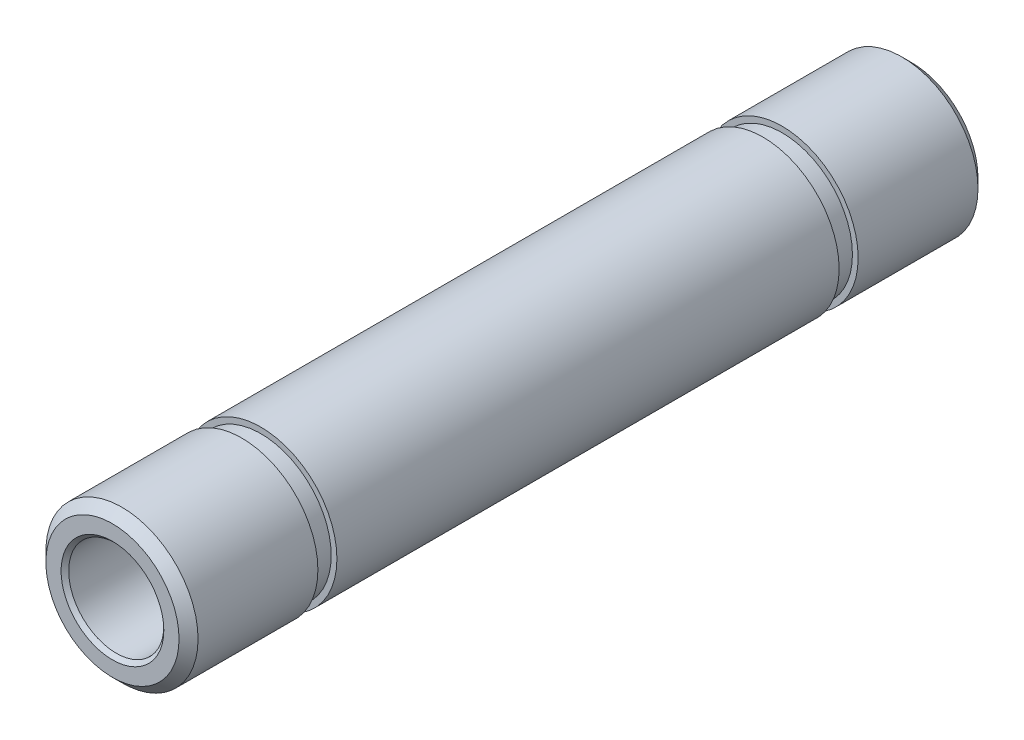
ISO-10303-21;
HEADER;
FILE_DESCRIPTION(('STEP AP214'),'2;1');
FILE_NAME('part.step','',(''),(''),'','','');
FILE_SCHEMA(('AUTOMOTIVE_DESIGN { 1 0 10303 214 1 1 1 1 }'));
ENDSEC;
DATA;
#1=APPLICATION_CONTEXT('core data for automotive mechanical design processes');
#2=APPLICATION_PROTOCOL_DEFINITION('international standard','automotive_design',2000,#1);
#3=PRODUCT_CONTEXT('',#1,'mechanical');
#4=PRODUCT('Part','Part','',(#3));
#5=PRODUCT_RELATED_PRODUCT_CATEGORY('part','',(#4));
#6=PRODUCT_DEFINITION_FORMATION('','',#4);
#7=PRODUCT_DEFINITION_CONTEXT('part definition',#1,'design');
#8=PRODUCT_DEFINITION('design','',#6,#7);
#9=PRODUCT_DEFINITION_SHAPE('','',#8);
#10=(LENGTH_UNIT() NAMED_UNIT(*) SI_UNIT(.MILLI.,.METRE.));
#11=(NAMED_UNIT(*) PLANE_ANGLE_UNIT() SI_UNIT($,.RADIAN.));
#12=(NAMED_UNIT(*) SI_UNIT($,.STERADIAN.) SOLID_ANGLE_UNIT());
#13=UNCERTAINTY_MEASURE_WITH_UNIT(LENGTH_MEASURE(1.E-05),#10,'distance_accuracy_value','');
#14=(GEOMETRIC_REPRESENTATION_CONTEXT(3) GLOBAL_UNCERTAINTY_ASSIGNED_CONTEXT((#13)) GLOBAL_UNIT_ASSIGNED_CONTEXT((#10,
#11,#12)) REPRESENTATION_CONTEXT('',''));
#15=CARTESIAN_POINT('',(0.,0.,0.));
#16=DIRECTION('',(0.,0.,1.));
#17=DIRECTION('',(1.,0.,0.));
#18=AXIS2_PLACEMENT_3D('',#15,#16,#17);
#19=CARTESIAN_POINT('',(0.,0.,-42.));
#20=DIRECTION('',(0.,0.,1.));
#21=DIRECTION('',(1.,0.,0.));
#22=AXIS2_PLACEMENT_3D('',#19,#20,#21);
#23=CYLINDRICAL_SURFACE('',#22,4.);
#24=CARTESIAN_POINT('',(0.,0.,-41.5));
#25=DIRECTION('',(0.,0.,1.));
#26=DIRECTION('',(1.,0.,0.));
#27=AXIS2_PLACEMENT_3D('',#24,#25,#26);
#28=CIRCLE('',#27,4.);
#29=CARTESIAN_POINT('',(4.,0.,-41.5));
#30=VERTEX_POINT('',#29);
#31=EDGE_CURVE('E36',#30,#30,#28,.T.);
#32=ORIENTED_EDGE('',*,*,#31,.T.);
#33=EDGE_LOOP('',(#32));
#34=FACE_BOUND('',#33,.T.);
#35=CARTESIAN_POINT('',(0.,0.,-35.2));
#36=DIRECTION('',(0.,0.,1.));
#37=DIRECTION('',(1.,0.,0.));
#38=AXIS2_PLACEMENT_3D('',#35,#36,#37);
#39=CIRCLE('',#38,4.);
#40=CARTESIAN_POINT('',(4.,0.,-35.2));
#41=VERTEX_POINT('',#40);
#42=EDGE_CURVE('E58',#41,#41,#39,.T.);
#43=ORIENTED_EDGE('',*,*,#42,.F.);
#44=EDGE_LOOP('',(#43));
#45=FACE_BOUND('',#44,.T.);
#46=ADVANCED_FACE('F13',(#34,#45),#23,.T.);
#47=CARTESIAN_POINT('',(0.,0.,-34.2));
#48=DIRECTION('',(0.,0.,1.));
#49=DIRECTION('',(1.,0.,0.));
#50=AXIS2_PLACEMENT_3D('',#47,#48,#49);
#51=CIRCLE('',#50,4.);
#52=CARTESIAN_POINT('',(4.,0.,-34.2));
#53=VERTEX_POINT('',#52);
#54=EDGE_CURVE('E55',#53,#53,#51,.T.);
#55=ORIENTED_EDGE('',*,*,#54,.T.);
#56=EDGE_LOOP('',(#55));
#57=FACE_BOUND('',#56,.T.);
#58=CARTESIAN_POINT('',(0.,0.,-7.8));
#59=DIRECTION('',(0.,0.,1.));
#60=DIRECTION('',(1.,0.,0.));
#61=AXIS2_PLACEMENT_3D('',#58,#59,#60);
#62=CIRCLE('',#61,4.);
#63=CARTESIAN_POINT('',(4.,0.,-7.8));
#64=VERTEX_POINT('',#63);
#65=EDGE_CURVE('E45',#64,#64,#62,.T.);
#66=ORIENTED_EDGE('',*,*,#65,.F.);
#67=EDGE_LOOP('',(#66));
#68=FACE_BOUND('',#67,.T.);
#69=ADVANCED_FACE('F92',(#57,#68),#23,.T.);
#70=CARTESIAN_POINT('',(0.,0.,-0.5));
#71=DIRECTION('',(0.,0.,1.));
#72=DIRECTION('',(1.,0.,0.));
#73=AXIS2_PLACEMENT_3D('',#70,#71,#72);
#74=CIRCLE('',#73,4.);
#75=CARTESIAN_POINT('',(4.,0.,-0.5));
#76=VERTEX_POINT('',#75);
#77=EDGE_CURVE('E39',#76,#76,#74,.F.);
#78=ORIENTED_EDGE('',*,*,#77,.T.);
#79=EDGE_LOOP('',(#78));
#80=FACE_BOUND('',#79,.T.);
#81=CARTESIAN_POINT('',(0.,0.,-6.8));
#82=DIRECTION('',(0.,0.,1.));
#83=DIRECTION('',(1.,0.,0.));
#84=AXIS2_PLACEMENT_3D('',#81,#82,#83);
#85=CIRCLE('',#84,4.);
#86=CARTESIAN_POINT('',(4.,0.,-6.8));
#87=VERTEX_POINT('',#86);
#88=EDGE_CURVE('E46',#87,#87,#85,.T.);
#89=ORIENTED_EDGE('',*,*,#88,.T.);
#90=EDGE_LOOP('',(#89));
#91=FACE_BOUND('',#90,.T.);
#92=ADVANCED_FACE('F95',(#80,#91),#23,.T.);
#93=CARTESIAN_POINT('',(0.,0.,-42.));
#94=DIRECTION('',(0.,0.,1.));
#95=DIRECTION('',(1.,0.,0.));
#96=AXIS2_PLACEMENT_3D('',#93,#94,#95);
#97=PLANE('',#96);
#98=CARTESIAN_POINT('',(0.,0.,-42.));
#99=DIRECTION('',(0.,0.,1.));
#100=DIRECTION('',(1.,0.,0.));
#101=AXIS2_PLACEMENT_3D('',#98,#99,#100);
#102=CIRCLE('',#101,2.69999999999998);
#103=CARTESIAN_POINT('',(2.69999999999998,0.,-42.));
#104=VERTEX_POINT('',#103);
#105=EDGE_CURVE('E20',#104,#104,#102,.T.);
#106=ORIENTED_EDGE('',*,*,#105,.T.);
#107=EDGE_LOOP('',(#106));
#108=FACE_BOUND('',#107,.T.);
#109=CARTESIAN_POINT('',(0.,0.,-42.));
#110=DIRECTION('',(0.,0.,1.));
#111=DIRECTION('',(1.,0.,0.));
#112=AXIS2_PLACEMENT_3D('',#109,#110,#111);
#113=CIRCLE('',#112,3.49999999999998);
#114=CARTESIAN_POINT('',(3.49999999999998,0.,-42.));
#115=VERTEX_POINT('',#114);
#116=EDGE_CURVE('E33',#115,#115,#113,.F.);
#117=ORIENTED_EDGE('',*,*,#116,.T.);
#118=EDGE_LOOP('',(#117));
#119=FACE_BOUND('',#118,.T.);
#120=ADVANCED_FACE('F104',(#108,#119),#97,.F.);
#121=CARTESIAN_POINT('',(0.,0.,0.));
#122=DIRECTION('',(0.,0.,1.));
#123=DIRECTION('',(1.,0.,0.));
#124=AXIS2_PLACEMENT_3D('',#121,#122,#123);
#125=PLANE('',#124);
#126=CARTESIAN_POINT('',(0.,0.,0.));
#127=DIRECTION('',(0.,0.,1.));
#128=DIRECTION('',(1.,0.,0.));
#129=AXIS2_PLACEMENT_3D('',#126,#127,#128);
#130=CIRCLE('',#129,2.70000000000004);
#131=CARTESIAN_POINT('',(2.70000000000004,0.,0.));
#132=VERTEX_POINT('',#131);
#133=EDGE_CURVE('E24',#132,#132,#130,.F.);
#134=ORIENTED_EDGE('',*,*,#133,.T.);
#135=EDGE_LOOP('',(#134));
#136=FACE_BOUND('',#135,.T.);
#137=CARTESIAN_POINT('',(0.,0.,0.));
#138=DIRECTION('',(0.,0.,1.));
#139=DIRECTION('',(1.,0.,0.));
#140=AXIS2_PLACEMENT_3D('',#137,#138,#139);
#141=CIRCLE('',#140,3.5);
#142=CARTESIAN_POINT('',(3.5,0.,0.));
#143=VERTEX_POINT('',#142);
#144=EDGE_CURVE('E42',#143,#143,#141,.T.);
#145=ORIENTED_EDGE('',*,*,#144,.T.);
#146=EDGE_LOOP('',(#145));
#147=FACE_BOUND('',#146,.T.);
#148=ADVANCED_FACE('F109',(#136,#147),#125,.T.);
#149=CARTESIAN_POINT('',(0.,0.,-42.));
#150=DIRECTION('',(0.,0.,1.));
#151=DIRECTION('',(1.,0.,0.));
#152=AXIS2_PLACEMENT_3D('',#149,#150,#151);
#153=CYLINDRICAL_SURFACE('',#152,2.5);
#154=CARTESIAN_POINT('',(0.,0.,-41.8));
#155=DIRECTION('',(0.,0.,1.));
#156=DIRECTION('',(1.,0.,0.));
#157=AXIS2_PLACEMENT_3D('',#154,#155,#156);
#158=CIRCLE('',#157,2.5);
#159=CARTESIAN_POINT('',(2.5,0.,-41.8));
#160=VERTEX_POINT('',#159);
#161=EDGE_CURVE('E9',#160,#160,#158,.F.);
#162=ORIENTED_EDGE('',*,*,#161,.T.);
#163=EDGE_LOOP('',(#162));
#164=FACE_BOUND('',#163,.T.);
#165=CARTESIAN_POINT('',(0.,0.,-0.200000000000033));
#166=DIRECTION('',(0.,0.,1.));
#167=DIRECTION('',(1.,0.,0.));
#168=AXIS2_PLACEMENT_3D('',#165,#166,#167);
#169=CIRCLE('',#168,2.5);
#170=CARTESIAN_POINT('',(2.5,0.,-0.200000000000033));
#171=VERTEX_POINT('',#170);
#172=EDGE_CURVE('E28',#171,#171,#169,.T.);
#173=ORIENTED_EDGE('',*,*,#172,.T.);
#174=EDGE_LOOP('',(#173));
#175=FACE_BOUND('',#174,.T.);
#176=ADVANCED_FACE('F125',(#164,#175),#153,.F.);
#177=CARTESIAN_POINT('',(0.,0.,-7.8));
#178=DIRECTION('',(0.,0.,1.));
#179=DIRECTION('',(1.,0.,0.));
#180=AXIS2_PLACEMENT_3D('',#177,#178,#179);
#181=PLANE('',#180);
#182=CARTESIAN_POINT('',(0.,0.,-7.8));
#183=DIRECTION('',(0.,0.,1.));
#184=DIRECTION('',(1.,0.,0.));
#185=AXIS2_PLACEMENT_3D('',#182,#183,#184);
#186=CIRCLE('',#185,3.7);
#187=CARTESIAN_POINT('',(3.7,0.,-7.8));
#188=VERTEX_POINT('',#187);
#189=EDGE_CURVE('E49',#188,#188,#186,.T.);
#190=ORIENTED_EDGE('',*,*,#189,.F.);
#191=EDGE_LOOP('',(#190));
#192=FACE_BOUND('',#191,.T.);
#193=ORIENTED_EDGE('',*,*,#65,.T.);
#194=EDGE_LOOP('',(#193));
#195=FACE_BOUND('',#194,.T.);
#196=ADVANCED_FACE('F117',(#192,#195),#181,.T.);
#197=CARTESIAN_POINT('',(0.,0.,-6.8));
#198=DIRECTION('',(0.,0.,1.));
#199=DIRECTION('',(1.,0.,0.));
#200=AXIS2_PLACEMENT_3D('',#197,#198,#199);
#201=PLANE('',#200);
#202=CARTESIAN_POINT('',(0.,0.,-6.8));
#203=DIRECTION('',(0.,0.,1.));
#204=DIRECTION('',(1.,0.,0.));
#205=AXIS2_PLACEMENT_3D('',#202,#203,#204);
#206=CIRCLE('',#205,3.7);
#207=CARTESIAN_POINT('',(3.7,0.,-6.8));
#208=VERTEX_POINT('',#207);
#209=EDGE_CURVE('E52',#208,#208,#206,.T.);
#210=ORIENTED_EDGE('',*,*,#209,.T.);
#211=EDGE_LOOP('',(#210));
#212=FACE_BOUND('',#211,.T.);
#213=ORIENTED_EDGE('',*,*,#88,.F.);
#214=EDGE_LOOP('',(#213));
#215=FACE_BOUND('',#214,.T.);
#216=ADVANCED_FACE('F115',(#212,#215),#201,.F.);
#217=CARTESIAN_POINT('',(0.,0.,-7.8));
#218=DIRECTION('',(0.,0.,1.));
#219=DIRECTION('',(1.,0.,0.));
#220=AXIS2_PLACEMENT_3D('',#217,#218,#219);
#221=CYLINDRICAL_SURFACE('',#220,3.7);
#222=ORIENTED_EDGE('',*,*,#189,.T.);
#223=EDGE_LOOP('',(#222));
#224=FACE_BOUND('',#223,.T.);
#225=ORIENTED_EDGE('',*,*,#209,.F.);
#226=EDGE_LOOP('',(#225));
#227=FACE_BOUND('',#226,.T.);
#228=ADVANCED_FACE('F87',(#224,#227),#221,.T.);
#229=CARTESIAN_POINT('',(0.,0.,-34.2));
#230=DIRECTION('',(0.,0.,1.));
#231=DIRECTION('',(1.,0.,0.));
#232=AXIS2_PLACEMENT_3D('',#229,#230,#231);
#233=PLANE('',#232);
#234=ORIENTED_EDGE('',*,*,#54,.F.);
#235=EDGE_LOOP('',(#234));
#236=FACE_BOUND('',#235,.T.);
#237=CARTESIAN_POINT('',(0.,0.,-34.2));
#238=DIRECTION('',(0.,0.,1.));
#239=DIRECTION('',(1.,0.,0.));
#240=AXIS2_PLACEMENT_3D('',#237,#238,#239);
#241=CIRCLE('',#240,3.7);
#242=CARTESIAN_POINT('',(3.7,0.,-34.2));
#243=VERTEX_POINT('',#242);
#244=EDGE_CURVE('E61',#243,#243,#241,.T.);
#245=ORIENTED_EDGE('',*,*,#244,.T.);
#246=EDGE_LOOP('',(#245));
#247=FACE_BOUND('',#246,.T.);
#248=ADVANCED_FACE('F70',(#236,#247),#233,.F.);
#249=CARTESIAN_POINT('',(0.,0.,-35.2));
#250=DIRECTION('',(0.,0.,1.));
#251=DIRECTION('',(1.,0.,0.));
#252=AXIS2_PLACEMENT_3D('',#249,#250,#251);
#253=PLANE('',#252);
#254=ORIENTED_EDGE('',*,*,#42,.T.);
#255=EDGE_LOOP('',(#254));
#256=FACE_BOUND('',#255,.T.);
#257=CARTESIAN_POINT('',(0.,0.,-35.2));
#258=DIRECTION('',(0.,0.,1.));
#259=DIRECTION('',(1.,0.,0.));
#260=AXIS2_PLACEMENT_3D('',#257,#258,#259);
#261=CIRCLE('',#260,3.7);
#262=CARTESIAN_POINT('',(3.7,0.,-35.2));
#263=VERTEX_POINT('',#262);
#264=EDGE_CURVE('E64',#263,#263,#261,.T.);
#265=ORIENTED_EDGE('',*,*,#264,.F.);
#266=EDGE_LOOP('',(#265));
#267=FACE_BOUND('',#266,.T.);
#268=ADVANCED_FACE('F76',(#256,#267),#253,.T.);
#269=CARTESIAN_POINT('',(0.,0.,-34.2));
#270=DIRECTION('',(0.,0.,-1.));
#271=DIRECTION('',(-1.,0.,0.));
#272=AXIS2_PLACEMENT_3D('',#269,#270,#271);
#273=CYLINDRICAL_SURFACE('',#272,3.7);
#274=ORIENTED_EDGE('',*,*,#244,.F.);
#275=EDGE_LOOP('',(#274));
#276=FACE_BOUND('',#275,.T.);
#277=ORIENTED_EDGE('',*,*,#264,.T.);
#278=EDGE_LOOP('',(#277));
#279=FACE_BOUND('',#278,.T.);
#280=ADVANCED_FACE('F72',(#276,#279),#273,.T.);
#281=CARTESIAN_POINT('',(0.,0.,0.));
#282=DIRECTION('',(0.,0.,-1.));
#283=DIRECTION('',(-1.,0.,0.));
#284=AXIS2_PLACEMENT_3D('',#281,#282,#283);
#285=CONICAL_SURFACE('',#284,3.5,0.785398163397454);
#286=ORIENTED_EDGE('',*,*,#77,.F.);
#287=EDGE_LOOP('',(#286));
#288=FACE_BOUND('',#287,.T.);
#289=ORIENTED_EDGE('',*,*,#144,.F.);
#290=EDGE_LOOP('',(#289));
#291=FACE_BOUND('',#290,.T.);
#292=ADVANCED_FACE('F75',(#288,#291),#285,.T.);
#293=CARTESIAN_POINT('',(0.,0.,-41.5));
#294=DIRECTION('',(0.,0.,1.));
#295=DIRECTION('',(1.,0.,0.));
#296=AXIS2_PLACEMENT_3D('',#293,#294,#295);
#297=CONICAL_SURFACE('',#296,4.,0.785398163397446);
#298=ORIENTED_EDGE('',*,*,#116,.F.);
#299=EDGE_LOOP('',(#298));
#300=FACE_BOUND('',#299,.T.);
#301=ORIENTED_EDGE('',*,*,#31,.F.);
#302=EDGE_LOOP('',(#301));
#303=FACE_BOUND('',#302,.T.);
#304=ADVANCED_FACE('F139',(#300,#303),#297,.T.);
#305=CARTESIAN_POINT('',(0.,0.,-0.200000000000033));
#306=DIRECTION('',(0.,0.,1.));
#307=DIRECTION('',(1.,0.,0.));
#308=AXIS2_PLACEMENT_3D('',#305,#306,#307);
#309=CONICAL_SURFACE('',#308,2.5,0.785398163397453);
#310=ORIENTED_EDGE('',*,*,#133,.F.);
#311=EDGE_LOOP('',(#310));
#312=FACE_BOUND('',#311,.T.);
#313=ORIENTED_EDGE('',*,*,#172,.F.);
#314=EDGE_LOOP('',(#313));
#315=FACE_BOUND('',#314,.T.);
#316=ADVANCED_FACE('F144',(#312,#315),#309,.F.);
#317=CARTESIAN_POINT('',(0.,0.,-42.));
#318=DIRECTION('',(0.,0.,-1.));
#319=DIRECTION('',(-1.,0.,0.));
#320=AXIS2_PLACEMENT_3D('',#317,#318,#319);
#321=CONICAL_SURFACE('',#320,2.69999999999998,0.785398163397444);
#322=ORIENTED_EDGE('',*,*,#161,.F.);
#323=EDGE_LOOP('',(#322));
#324=FACE_BOUND('',#323,.T.);
#325=ORIENTED_EDGE('',*,*,#105,.F.);
#326=EDGE_LOOP('',(#325));
#327=FACE_BOUND('',#326,.T.);
#328=ADVANCED_FACE('F15',(#324,#327),#321,.F.);
#329=CLOSED_SHELL('',(#46,#69,#92,#120,#148,#176,#196,#216,#228,#248,#268,#280,#292,#304,#316,#328));
#330=MANIFOLD_SOLID_BREP('B1',#329);
#331=ADVANCED_BREP_SHAPE_REPRESENTATION('',(#18,#330),#14);
#332=SHAPE_DEFINITION_REPRESENTATION(#9,#331);
ENDSEC;
END-ISO-10303-21;
